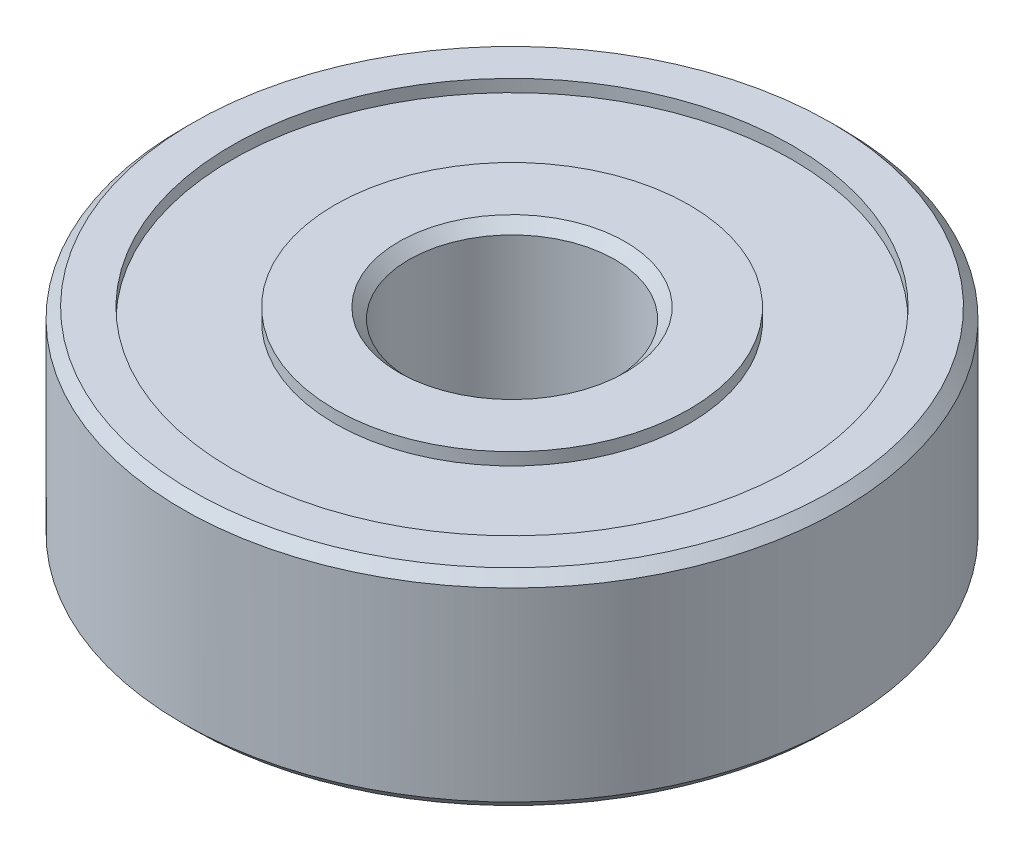
ISO-10303-21;
HEADER;
FILE_DESCRIPTION(('STEP AP214'),'2;1');
FILE_NAME('part.step','',(''),(''),'','','');
FILE_SCHEMA(('AUTOMOTIVE_DESIGN { 1 0 10303 214 1 1 1 1 }'));
ENDSEC;
DATA;
#1=APPLICATION_CONTEXT('core data for automotive mechanical design processes');
#2=APPLICATION_PROTOCOL_DEFINITION('international standard','automotive_design',2000,#1);
#3=PRODUCT_CONTEXT('',#1,'mechanical');
#4=PRODUCT('Part','Part','',(#3));
#5=PRODUCT_RELATED_PRODUCT_CATEGORY('part','',(#4));
#6=PRODUCT_DEFINITION_FORMATION('','',#4);
#7=PRODUCT_DEFINITION_CONTEXT('part definition',#1,'design');
#8=PRODUCT_DEFINITION('design','',#6,#7);
#9=PRODUCT_DEFINITION_SHAPE('','',#8);
#10=(LENGTH_UNIT() NAMED_UNIT(*) SI_UNIT(.MILLI.,.METRE.));
#11=(NAMED_UNIT(*) PLANE_ANGLE_UNIT() SI_UNIT($,.RADIAN.));
#12=(NAMED_UNIT(*) SI_UNIT($,.STERADIAN.) SOLID_ANGLE_UNIT());
#13=UNCERTAINTY_MEASURE_WITH_UNIT(LENGTH_MEASURE(1.E-05),#10,'distance_accuracy_value','');
#14=(GEOMETRIC_REPRESENTATION_CONTEXT(3) GLOBAL_UNCERTAINTY_ASSIGNED_CONTEXT((#13)) GLOBAL_UNIT_ASSIGNED_CONTEXT((#10,
#11,#12)) REPRESENTATION_CONTEXT('',''));
#15=CARTESIAN_POINT('',(0.,0.,0.));
#16=DIRECTION('',(0.,0.,1.));
#17=DIRECTION('',(1.,0.,0.));
#18=AXIS2_PLACEMENT_3D('',#15,#16,#17);
#19=CARTESIAN_POINT('',(0.,-2.75,0.));
#20=DIRECTION('',(0.,-1.,0.));
#21=DIRECTION('',(0.,0.,-1.));
#22=AXIS2_PLACEMENT_3D('',#19,#20,#21);
#23=CYLINDRICAL_SURFACE('',#22,2.5);
#24=CARTESIAN_POINT('',(0.,-5.24999999998954,0.));
#25=DIRECTION('',(0.,-1.,0.));
#26=DIRECTION('',(0.,0.,-1.));
#27=AXIS2_PLACEMENT_3D('',#24,#25,#26);
#28=CIRCLE('',#27,2.49999999999773);
#29=CARTESIAN_POINT('',(0.,-5.24999999998954,-2.49999999999773));
#30=VERTEX_POINT('',#29);
#31=EDGE_CURVE('E37',#30,#30,#28,.T.);
#32=ORIENTED_EDGE('',*,*,#31,.T.);
#33=EDGE_LOOP('',(#32));
#34=FACE_BOUND('',#33,.T.);
#35=CARTESIAN_POINT('',(0.,-0.750000000039108,0.));
#36=DIRECTION('',(0.,1.,0.));
#37=DIRECTION('',(0.,0.,1.));
#38=AXIS2_PLACEMENT_3D('',#35,#36,#37);
#39=CIRCLE('',#38,2.49999999994088);
#40=CARTESIAN_POINT('',(0.,-0.750000000039108,2.49999999994088));
#41=VERTEX_POINT('',#40);
#42=EDGE_CURVE('E34',#41,#41,#39,.T.);
#43=ORIENTED_EDGE('',*,*,#42,.T.);
#44=EDGE_LOOP('',(#43));
#45=FACE_BOUND('',#44,.T.);
#46=ADVANCED_FACE('F15',(#34,#45),#23,.F.);
#47=CARTESIAN_POINT('',(0.,-5.49999999992679,0.));
#48=DIRECTION('',(0.,-1.,0.));
#49=DIRECTION('',(0.,0.,-1.));
#50=AXIS2_PLACEMENT_3D('',#47,#48,#49);
#51=CONICAL_SURFACE('',#50,2.74999999993497,0.785398163397448);
#52=CARTESIAN_POINT('',(0.,-5.50000000004047,0.));
#53=DIRECTION('',(0.,-1.,0.));
#54=DIRECTION('',(0.,0.,-1.));
#55=AXIS2_PLACEMENT_3D('',#52,#53,#54);
#56=CIRCLE('',#55,2.75000000004866);
#57=CARTESIAN_POINT('',(0.,-5.50000000004047,-2.75000000004866));
#58=VERTEX_POINT('',#57);
#59=EDGE_CURVE('E18',#58,#58,#56,.T.);
#60=ORIENTED_EDGE('',*,*,#59,.T.);
#61=EDGE_LOOP('',(#60));
#62=FACE_BOUND('',#61,.T.);
#63=ORIENTED_EDGE('',*,*,#31,.F.);
#64=EDGE_LOOP('',(#63));
#65=FACE_BOUND('',#64,.T.);
#66=ADVANCED_FACE('F77',(#62,#65),#51,.F.);
#67=CARTESIAN_POINT('',(0.,-0.500000000101863,0.));
#68=DIRECTION('',(0.,1.,0.));
#69=DIRECTION('',(0.,0.,1.));
#70=AXIS2_PLACEMENT_3D('',#67,#68,#69);
#71=CONICAL_SURFACE('',#70,2.74999999987813,0.785398163397448);
#72=CARTESIAN_POINT('',(0.,-0.50000000004502,0.));
#73=DIRECTION('',(0.,1.,0.));
#74=DIRECTION('',(0.,0.,1.));
#75=AXIS2_PLACEMENT_3D('',#72,#73,#74);
#76=CIRCLE('',#75,2.74999999993497);
#77=CARTESIAN_POINT('',(0.,-0.50000000004502,2.74999999993497));
#78=VERTEX_POINT('',#77);
#79=EDGE_CURVE('E70',#78,#78,#76,.F.);
#80=ORIENTED_EDGE('',*,*,#79,.F.);
#81=EDGE_LOOP('',(#80));
#82=FACE_BOUND('',#81,.T.);
#83=ORIENTED_EDGE('',*,*,#42,.F.);
#84=EDGE_LOOP('',(#83));
#85=FACE_BOUND('',#84,.T.);
#86=ADVANCED_FACE('F84',(#82,#85),#71,.F.);
#87=CARTESIAN_POINT('',(0.,-5.5,3.76622147383255));
#88=DIRECTION('',(0.,1.,0.));
#89=DIRECTION('',(0.,0.,1.));
#90=AXIS2_PLACEMENT_3D('',#87,#88,#89);
#91=PLANE('',#90);
#92=ORIENTED_EDGE('',*,*,#59,.F.);
#93=EDGE_LOOP('',(#92));
#94=FACE_BOUND('',#93,.T.);
#95=CARTESIAN_POINT('',(0.,-5.5,0.));
#96=DIRECTION('',(0.,-1.,0.));
#97=DIRECTION('',(0.,0.,-1.));
#98=AXIS2_PLACEMENT_3D('',#95,#96,#97);
#99=CIRCLE('',#98,4.3);
#100=CARTESIAN_POINT('',(0.,-5.5,-4.3));
#101=VERTEX_POINT('',#100);
#102=EDGE_CURVE('E68',#101,#101,#99,.F.);
#103=ORIENTED_EDGE('',*,*,#102,.F.);
#104=EDGE_LOOP('',(#103));
#105=FACE_BOUND('',#104,.T.);
#106=ADVANCED_FACE('F80',(#94,#105),#91,.F.);
#107=CARTESIAN_POINT('',(0.,-0.5,3.69103716327336));
#108=DIRECTION('',(0.,1.,0.));
#109=DIRECTION('',(0.,0.,1.));
#110=AXIS2_PLACEMENT_3D('',#107,#108,#109);
#111=PLANE('',#110);
#112=ORIENTED_EDGE('',*,*,#79,.T.);
#113=EDGE_LOOP('',(#112));
#114=FACE_BOUND('',#113,.T.);
#115=CARTESIAN_POINT('',(0.,-0.5,0.));
#116=DIRECTION('',(0.,-1.,0.));
#117=DIRECTION('',(0.,0.,-1.));
#118=AXIS2_PLACEMENT_3D('',#115,#116,#117);
#119=CIRCLE('',#118,4.3);
#120=CARTESIAN_POINT('',(0.,-0.5,-4.3));
#121=VERTEX_POINT('',#120);
#122=EDGE_CURVE('E65',#121,#121,#119,.T.);
#123=ORIENTED_EDGE('',*,*,#122,.F.);
#124=EDGE_LOOP('',(#123));
#125=FACE_BOUND('',#124,.T.);
#126=ADVANCED_FACE('F83',(#114,#125),#111,.T.);
#127=CARTESIAN_POINT('',(0.,-2.75,0.));
#128=DIRECTION('',(0.,-1.,0.));
#129=DIRECTION('',(0.,0.,-1.));
#130=AXIS2_PLACEMENT_3D('',#127,#128,#129);
#131=CYLINDRICAL_SURFACE('',#130,4.3);
#132=CARTESIAN_POINT('',(0.,-5.2,0.));
#133=DIRECTION('',(0.,-1.,0.));
#134=DIRECTION('',(0.,0.,-1.));
#135=AXIS2_PLACEMENT_3D('',#132,#133,#134);
#136=CIRCLE('',#135,4.3);
#137=CARTESIAN_POINT('',(0.,-5.2,-4.3));
#138=VERTEX_POINT('',#137);
#139=EDGE_CURVE('E62',#138,#138,#136,.T.);
#140=ORIENTED_EDGE('',*,*,#139,.T.);
#141=EDGE_LOOP('',(#140));
#142=FACE_BOUND('',#141,.T.);
#143=ORIENTED_EDGE('',*,*,#102,.T.);
#144=EDGE_LOOP('',(#143));
#145=FACE_BOUND('',#144,.T.);
#146=ADVANCED_FACE('F88',(#142,#145),#131,.T.);
#147=CARTESIAN_POINT('',(0.,-2.75,0.));
#148=DIRECTION('',(0.,-1.,0.));
#149=DIRECTION('',(0.,0.,-1.));
#150=AXIS2_PLACEMENT_3D('',#147,#148,#149);
#151=CYLINDRICAL_SURFACE('',#150,4.3);
#152=ORIENTED_EDGE('',*,*,#122,.T.);
#153=EDGE_LOOP('',(#152));
#154=FACE_BOUND('',#153,.T.);
#155=CARTESIAN_POINT('',(0.,-0.8,0.));
#156=DIRECTION('',(0.,-1.,0.));
#157=DIRECTION('',(0.,0.,-1.));
#158=AXIS2_PLACEMENT_3D('',#155,#156,#157);
#159=CIRCLE('',#158,4.3);
#160=CARTESIAN_POINT('',(0.,-0.8,-4.3));
#161=VERTEX_POINT('',#160);
#162=EDGE_CURVE('E59',#161,#161,#159,.T.);
#163=ORIENTED_EDGE('',*,*,#162,.F.);
#164=EDGE_LOOP('',(#163));
#165=FACE_BOUND('',#164,.T.);
#166=ADVANCED_FACE('F90',(#154,#165),#151,.T.);
#167=CARTESIAN_POINT('',(0.,-5.2,9.39446439308601));
#168=DIRECTION('',(0.,1.,0.));
#169=DIRECTION('',(0.,0.,1.));
#170=AXIS2_PLACEMENT_3D('',#167,#168,#169);
#171=PLANE('',#170);
#172=ORIENTED_EDGE('',*,*,#139,.F.);
#173=EDGE_LOOP('',(#172));
#174=FACE_BOUND('',#173,.T.);
#175=CARTESIAN_POINT('',(0.,-5.2,0.));
#176=DIRECTION('',(0.,-1.,0.));
#177=DIRECTION('',(0.,0.,-1.));
#178=AXIS2_PLACEMENT_3D('',#175,#176,#177);
#179=CIRCLE('',#178,6.8);
#180=CARTESIAN_POINT('',(0.,-5.2,-6.8));
#181=VERTEX_POINT('',#180);
#182=EDGE_CURVE('E56',#181,#181,#179,.T.);
#183=ORIENTED_EDGE('',*,*,#182,.T.);
#184=EDGE_LOOP('',(#183));
#185=FACE_BOUND('',#184,.T.);
#186=ADVANCED_FACE('F98',(#174,#185),#171,.F.);
#187=CARTESIAN_POINT('',(0.,-0.8,12.1442202207571));
#188=DIRECTION('',(0.,1.,0.));
#189=DIRECTION('',(0.,0.,1.));
#190=AXIS2_PLACEMENT_3D('',#187,#188,#189);
#191=PLANE('',#190);
#192=ORIENTED_EDGE('',*,*,#162,.T.);
#193=EDGE_LOOP('',(#192));
#194=FACE_BOUND('',#193,.T.);
#195=CARTESIAN_POINT('',(0.,-0.8,0.));
#196=DIRECTION('',(0.,-1.,0.));
#197=DIRECTION('',(0.,0.,-1.));
#198=AXIS2_PLACEMENT_3D('',#195,#196,#197);
#199=CIRCLE('',#198,6.8);
#200=CARTESIAN_POINT('',(0.,-0.8,-6.8));
#201=VERTEX_POINT('',#200);
#202=EDGE_CURVE('E53',#201,#201,#199,.F.);
#203=ORIENTED_EDGE('',*,*,#202,.T.);
#204=EDGE_LOOP('',(#203));
#205=FACE_BOUND('',#204,.T.);
#206=ADVANCED_FACE('F132',(#194,#205),#191,.T.);
#207=CARTESIAN_POINT('',(0.,-2.75,0.));
#208=DIRECTION('',(0.,-1.,0.));
#209=DIRECTION('',(0.,0.,-1.));
#210=AXIS2_PLACEMENT_3D('',#207,#208,#209);
#211=CYLINDRICAL_SURFACE('',#210,6.8);
#212=CARTESIAN_POINT('',(0.,-5.5,0.));
#213=DIRECTION('',(0.,-1.,0.));
#214=DIRECTION('',(0.,0.,-1.));
#215=AXIS2_PLACEMENT_3D('',#212,#213,#214);
#216=CIRCLE('',#215,6.8);
#217=CARTESIAN_POINT('',(0.,-5.5,-6.8));
#218=VERTEX_POINT('',#217);
#219=EDGE_CURVE('E50',#218,#218,#216,.T.);
#220=ORIENTED_EDGE('',*,*,#219,.T.);
#221=EDGE_LOOP('',(#220));
#222=FACE_BOUND('',#221,.T.);
#223=ORIENTED_EDGE('',*,*,#182,.F.);
#224=EDGE_LOOP('',(#223));
#225=FACE_BOUND('',#224,.T.);
#226=ADVANCED_FACE('F128',(#222,#225),#211,.F.);
#227=CARTESIAN_POINT('',(0.,-2.75,0.));
#228=DIRECTION('',(0.,-1.,0.));
#229=DIRECTION('',(0.,0.,-1.));
#230=AXIS2_PLACEMENT_3D('',#227,#228,#229);
#231=CYLINDRICAL_SURFACE('',#230,6.8);
#232=ORIENTED_EDGE('',*,*,#202,.F.);
#233=EDGE_LOOP('',(#232));
#234=FACE_BOUND('',#233,.T.);
#235=CARTESIAN_POINT('',(0.,-0.5,0.));
#236=DIRECTION('',(0.,-1.,0.));
#237=DIRECTION('',(0.,0.,-1.));
#238=AXIS2_PLACEMENT_3D('',#235,#236,#237);
#239=CIRCLE('',#238,6.8);
#240=CARTESIAN_POINT('',(0.,-0.5,-6.8));
#241=VERTEX_POINT('',#240);
#242=EDGE_CURVE('E47',#241,#241,#239,.T.);
#243=ORIENTED_EDGE('',*,*,#242,.F.);
#244=EDGE_LOOP('',(#243));
#245=FACE_BOUND('',#244,.T.);
#246=ADVANCED_FACE('F124',(#234,#245),#231,.F.);
#247=CARTESIAN_POINT('',(0.,-5.5,11.4498215694482));
#248=DIRECTION('',(0.,1.,0.));
#249=DIRECTION('',(0.,0.,1.));
#250=AXIS2_PLACEMENT_3D('',#247,#248,#249);
#251=PLANE('',#250);
#252=ORIENTED_EDGE('',*,*,#219,.F.);
#253=EDGE_LOOP('',(#252));
#254=FACE_BOUND('',#253,.T.);
#255=CARTESIAN_POINT('',(0.,-5.49999999999936,0.));
#256=DIRECTION('',(0.,1.,0.));
#257=DIRECTION('',(0.,0.,1.));
#258=AXIS2_PLACEMENT_3D('',#255,#256,#257);
#259=CIRCLE('',#258,7.74999999999936);
#260=CARTESIAN_POINT('',(0.,-5.49999999999936,7.74999999999936));
#261=VERTEX_POINT('',#260);
#262=EDGE_CURVE('E44',#261,#261,#259,.T.);
#263=ORIENTED_EDGE('',*,*,#262,.F.);
#264=EDGE_LOOP('',(#263));
#265=FACE_BOUND('',#264,.T.);
#266=ADVANCED_FACE('F120',(#254,#265),#251,.F.);
#267=CARTESIAN_POINT('',(0.,-0.5,12.0382754432181));
#268=DIRECTION('',(0.,1.,0.));
#269=DIRECTION('',(0.,0.,1.));
#270=AXIS2_PLACEMENT_3D('',#267,#268,#269);
#271=PLANE('',#270);
#272=ORIENTED_EDGE('',*,*,#242,.T.);
#273=EDGE_LOOP('',(#272));
#274=FACE_BOUND('',#273,.T.);
#275=CARTESIAN_POINT('',(0.,-0.500000000000001,0.));
#276=DIRECTION('',(0.,-1.,0.));
#277=DIRECTION('',(0.,0.,-1.));
#278=AXIS2_PLACEMENT_3D('',#275,#276,#277);
#279=CIRCLE('',#278,7.75);
#280=CARTESIAN_POINT('',(0.,-0.500000000000001,-7.75));
#281=VERTEX_POINT('',#280);
#282=EDGE_CURVE('E27',#281,#281,#279,.T.);
#283=ORIENTED_EDGE('',*,*,#282,.F.);
#284=EDGE_LOOP('',(#283));
#285=FACE_BOUND('',#284,.T.);
#286=ADVANCED_FACE('F116',(#274,#285),#271,.T.);
#287=CARTESIAN_POINT('',(0.,-5.25,0.));
#288=DIRECTION('',(0.,1.,0.));
#289=DIRECTION('',(0.,0.,1.));
#290=AXIS2_PLACEMENT_3D('',#287,#288,#289);
#291=CONICAL_SURFACE('',#290,8.,0.7853981634);
#292=ORIENTED_EDGE('',*,*,#262,.T.);
#293=EDGE_LOOP('',(#292));
#294=FACE_BOUND('',#293,.T.);
#295=CARTESIAN_POINT('',(0.,-5.25,0.));
#296=DIRECTION('',(0.,-1.,0.));
#297=DIRECTION('',(0.,0.,-1.));
#298=AXIS2_PLACEMENT_3D('',#295,#296,#297);
#299=CIRCLE('',#298,8.);
#300=CARTESIAN_POINT('',(0.,-5.25,-8.));
#301=VERTEX_POINT('',#300);
#302=EDGE_CURVE('E22',#301,#301,#299,.F.);
#303=ORIENTED_EDGE('',*,*,#302,.F.);
#304=EDGE_LOOP('',(#303));
#305=FACE_BOUND('',#304,.T.);
#306=ADVANCED_FACE('F109',(#294,#305),#291,.T.);
#307=CARTESIAN_POINT('',(0.,-0.749999999999363,0.));
#308=DIRECTION('',(0.,-1.,0.));
#309=DIRECTION('',(0.,0.,-1.));
#310=AXIS2_PLACEMENT_3D('',#307,#308,#309);
#311=CONICAL_SURFACE('',#310,8.00000000000064,0.7853981634);
#312=ORIENTED_EDGE('',*,*,#282,.T.);
#313=EDGE_LOOP('',(#312));
#314=FACE_BOUND('',#313,.T.);
#315=CARTESIAN_POINT('',(0.,-0.75,0.));
#316=DIRECTION('',(0.,-1.,0.));
#317=DIRECTION('',(0.,0.,-1.));
#318=AXIS2_PLACEMENT_3D('',#315,#316,#317);
#319=CIRCLE('',#318,8.);
#320=CARTESIAN_POINT('',(0.,-0.75,-8.));
#321=VERTEX_POINT('',#320);
#322=EDGE_CURVE('E10',#321,#321,#319,.T.);
#323=ORIENTED_EDGE('',*,*,#322,.F.);
#324=EDGE_LOOP('',(#323));
#325=FACE_BOUND('',#324,.T.);
#326=ADVANCED_FACE('F104',(#314,#325),#311,.T.);
#327=CARTESIAN_POINT('',(0.,-2.75,0.));
#328=DIRECTION('',(0.,-1.,0.));
#329=DIRECTION('',(0.,0.,-1.));
#330=AXIS2_PLACEMENT_3D('',#327,#328,#329);
#331=CYLINDRICAL_SURFACE('',#330,8.);
#332=ORIENTED_EDGE('',*,*,#322,.T.);
#333=EDGE_LOOP('',(#332));
#334=FACE_BOUND('',#333,.T.);
#335=ORIENTED_EDGE('',*,*,#302,.T.);
#336=EDGE_LOOP('',(#335));
#337=FACE_BOUND('',#336,.T.);
#338=ADVANCED_FACE('F102',(#334,#337),#331,.T.);
#339=CLOSED_SHELL('',(#46,#66,#86,#106,#126,#146,#166,#186,#206,#226,#246,#266,#286,#306,#326,#338));
#340=MANIFOLD_SOLID_BREP('B1',#339);
#341=ADVANCED_BREP_SHAPE_REPRESENTATION('',(#18,#340),#14);
#342=SHAPE_DEFINITION_REPRESENTATION(#9,#341);
ENDSEC;
END-ISO-10303-21;
